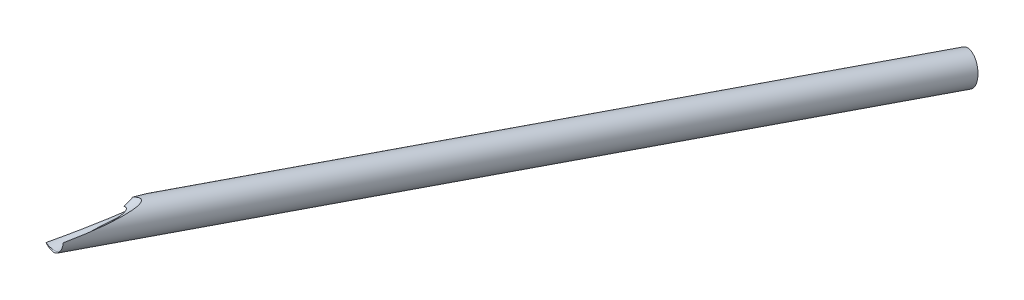
ISO-10303-21;
HEADER;
FILE_DESCRIPTION(('STEP AP214'),'2;1');
FILE_NAME('part.step','',(''),(''),'','','');
FILE_SCHEMA(('AUTOMOTIVE_DESIGN { 1 0 10303 214 1 1 1 1 }'));
ENDSEC;
DATA;
#1=APPLICATION_CONTEXT('core data for automotive mechanical design processes');
#2=APPLICATION_PROTOCOL_DEFINITION('international standard','automotive_design',2000,#1);
#3=PRODUCT_CONTEXT('',#1,'mechanical');
#4=PRODUCT('Part','Part','',(#3));
#5=PRODUCT_RELATED_PRODUCT_CATEGORY('part','',(#4));
#6=PRODUCT_DEFINITION_FORMATION('','',#4);
#7=PRODUCT_DEFINITION_CONTEXT('part definition',#1,'design');
#8=PRODUCT_DEFINITION('design','',#6,#7);
#9=PRODUCT_DEFINITION_SHAPE('','',#8);
#10=(LENGTH_UNIT() NAMED_UNIT(*) SI_UNIT(.MILLI.,.METRE.));
#11=(NAMED_UNIT(*) PLANE_ANGLE_UNIT() SI_UNIT($,.RADIAN.));
#12=(NAMED_UNIT(*) SI_UNIT($,.STERADIAN.) SOLID_ANGLE_UNIT());
#13=UNCERTAINTY_MEASURE_WITH_UNIT(LENGTH_MEASURE(1.E-05),#10,'distance_accuracy_value','');
#14=(GEOMETRIC_REPRESENTATION_CONTEXT(3) GLOBAL_UNCERTAINTY_ASSIGNED_CONTEXT((#13)) GLOBAL_UNIT_ASSIGNED_CONTEXT((#10,
#11,#12)) REPRESENTATION_CONTEXT('',''));
#15=CARTESIAN_POINT('',(0.,0.,0.));
#16=DIRECTION('',(0.,0.,1.));
#17=DIRECTION('',(1.,0.,0.));
#18=AXIS2_PLACEMENT_3D('',#15,#16,#17);
#19=CARTESIAN_POINT('',(204.165057136812,-72.1759348192313,0.));
#20=DIRECTION('',(-0.270716912176289,0.150111302046005,0.950883247543982));
#21=DIRECTION('',(0.961781089140047,0.,0.273819532854372));
#22=AXIS2_PLACEMENT_3D('',#19,#20,#21);
#23=CYLINDRICAL_SURFACE('',#22,6.35);
#24=CARTESIAN_POINT('',(201.504236252595,-70.7005216866344,9.34603598710279));
#25=DIRECTION('',(-0.270716912176287,0.150111302046004,0.950883247543982));
#26=DIRECTION('',(0.961781089140047,0.,0.27381953285437));
#27=AXIS2_PLACEMENT_3D('',#24,#25,#26);
#28=CIRCLE('',#27,6.35000000000003);
#29=CARTESIAN_POINT('',(207.611546168634,-70.7005216866344,11.084790020728));
#30=VERTEX_POINT('',#29);
#31=EDGE_CURVE('E125',#30,#30,#28,.F.);
#32=ORIENTED_EDGE('',*,*,#31,.T.);
#33=EDGE_LOOP('',(#32));
#34=FACE_BOUND('',#33,.T.);
#35=CARTESIAN_POINT('',(84.937381278847,-2.67825270101344,441.973305120907));
#36=CARTESIAN_POINT('',(85.0080305028037,-2.60997270455133,441.725150176863));
#37=CARTESIAN_POINT('',(85.0762820556866,-2.54390585253032,441.475710105905));
#38=CARTESIAN_POINT('',(85.2084455153859,-2.41572293297347,440.974669906557));
#39=CARTESIAN_POINT('',(85.2723572400839,-2.35360703124393,440.723069688015));
#40=CARTESIAN_POINT('',(85.4581669148907,-2.17251381806515,439.965441096851));
#41=CARTESIAN_POINT('',(85.5741123914815,-2.05881702012615,439.45668087914));
#42=CARTESIAN_POINT('',(85.7921748613013,-1.84258626363771,438.43321969733));
#43=CARTESIAN_POINT('',(85.8942744101389,-1.74006641814517,437.918512109638));
#44=CARTESIAN_POINT('',(86.0854160366441,-1.54421687573714,436.885011683273));
#45=CARTESIAN_POINT('',(86.1744595146209,-1.45088619360505,436.366219289008));
#46=CARTESIAN_POINT('',(86.3403085994945,-1.27113849599306,435.321802423362));
#47=CARTESIAN_POINT('',(86.4170274747312,-1.18477244209822,434.796155473834));
#48=CARTESIAN_POINT('',(86.5571213590262,-1.01834012400586,433.742059304372));
#49=CARTESIAN_POINT('',(86.6204955882662,-0.938274228140541,433.213609922522));
#50=CARTESIAN_POINT('',(86.7327971425554,-0.783512472736237,432.155040909262));
#51=CARTESIAN_POINT('',(86.7817415804266,-0.708810332340615,431.624924015988));
#52=CARTESIAN_POINT('',(86.8634963358982,-0.563873540305286,430.562860293761));
#53=CARTESIAN_POINT('',(86.8963084324885,-0.493638396812659,430.030913673098));
#54=CARTESIAN_POINT('',(86.9311870622714,-0.391271713272148,429.232777193159));
#55=CARTESIAN_POINT('',(86.9404203338568,-0.357693202982884,428.967076965773));
#56=CARTESIAN_POINT('',(86.9536145966935,-0.291433602136236,428.435437017015));
#57=CARTESIAN_POINT('',(86.9575757696242,-0.258752480692328,428.169497304211));
#58=CARTESIAN_POINT('',(86.9595786905414,-0.194196844193968,427.637167422242));
#59=CARTESIAN_POINT('',(86.9576132901291,-0.162323350008558,427.370777096741));
#60=CARTESIAN_POINT('',(86.9468967037916,-0.0993865110143857,426.838040676359));
#61=CARTESIAN_POINT('',(86.9381458239965,-0.0683231297223403,426.571694580025));
#62=CARTESIAN_POINT('',(86.9128516456834,-0.00726253004656791,426.041719337295));
#63=CARTESIAN_POINT('',(86.8963805439386,0.0227418532427247,425.778087674429));
#64=CARTESIAN_POINT('',(86.8541972764246,0.0819807579840199,425.251483336073));
#65=CARTESIAN_POINT('',(86.8284861279979,0.111215363809479,424.988510591244));
#66=CARTESIAN_POINT('',(86.765809295732,0.168837256545276,424.464279310444));
#67=CARTESIAN_POINT('',(86.7288639471016,0.197225973500198,424.203018541354));
#68=CARTESIAN_POINT('',(86.6407580401431,0.253121430519648,423.682851559662));
#69=CARTESIAN_POINT('',(86.589605877514,0.280628680822347,423.423944049411));
#70=CARTESIAN_POINT('',(86.5050383776016,0.318288515722412,423.065479579886));
#71=CARTESIAN_POINT('',(86.4795589911837,0.328892604863753,422.964086242846));
#72=CARTESIAN_POINT('',(86.4252180040416,0.349913503712436,422.762172795875));
#73=CARTESIAN_POINT('',(86.3963561052068,0.360330296819389,422.661652763752));
#74=CARTESIAN_POINT('',(86.3346729303103,0.380981677523946,422.461437716549));
#75=CARTESIAN_POINT('',(86.3018387726687,0.391215541737523,422.36174657014));
#76=CARTESIAN_POINT('',(86.2316877571649,0.411424487988732,422.163922572223));
#77=CARTESIAN_POINT('',(86.1943712002352,0.421399587344311,422.065789616604));
#78=CARTESIAN_POINT('',(86.1140277736969,0.441153673810756,421.87044442783));
#79=CARTESIAN_POINT('',(86.0709371698854,0.450928818134733,421.773257773685));
#80=CARTESIAN_POINT('',(85.9784678958168,0.470066893514413,421.581890195826));
#81=CARTESIAN_POINT('',(85.929091464149,0.47942996973132,421.487708216908));
#82=CARTESIAN_POINT('',(85.8230916780827,0.497585133611797,421.303892855089));
#83=CARTESIAN_POINT('',(85.7664972274021,0.506379298519382,421.214243220314));
#84=CARTESIAN_POINT('',(85.6446723250197,0.523238938799074,421.041016468724));
#85=CARTESIAN_POINT('',(85.5794533247249,0.53130535696603,420.957431523433));
#86=CARTESIAN_POINT('',(85.4422447535325,0.546101044379248,420.802523569224));
#87=CARTESIAN_POINT('',(85.370704180195,0.552874732856325,420.730813538967));
#88=CARTESIAN_POINT('',(85.2178512457452,0.565193904253794,420.598497876144));
#89=CARTESIAN_POINT('',(85.1365483192316,0.570740558506676,420.537881663));
#90=CARTESIAN_POINT('',(84.9635701217338,0.580291282418555,420.430887774213));
#91=CARTESIAN_POINT('',(84.8717912986951,0.58427784928626,420.384672777513));
#92=CARTESIAN_POINT('',(84.6809993124724,0.590302139186548,420.310773795971));
#93=CARTESIAN_POINT('',(84.5819918995642,0.592341393491483,420.283075255833));
#94=CARTESIAN_POINT('',(84.391790460157,0.594293202286596,420.24912129198));
#95=CARTESIAN_POINT('',(84.3009500404547,0.594416815540983,420.240825853012));
#96=CARTESIAN_POINT('',(84.1191098765807,0.593210537783619,420.238411669216));
#97=CARTESIAN_POINT('',(84.0281100626371,0.591879417186736,420.24430492217));
#98=CARTESIAN_POINT('',(83.8018970882141,0.586990199082746,420.27428059754));
#99=CARTESIAN_POINT('',(83.6677539154204,0.582643469747773,420.306094038862));
#100=CARTESIAN_POINT('',(83.4059478295686,0.571908664774682,420.389695701431));
#101=CARTESIAN_POINT('',(83.2783050249338,0.565514653726928,420.441542093027));
#102=CARTESIAN_POINT('',(83.0361375056442,0.551620586412859,420.556423684508));
#103=CARTESIAN_POINT('',(82.9212761128283,0.544191287522855,420.61877479968));
#104=CARTESIAN_POINT('',(82.6972043661229,0.528334923406585,420.752901613333));
#105=CARTESIAN_POINT('',(82.5879996881568,0.519906882888208,420.824686531699));
#106=CARTESIAN_POINT('',(82.3744300056348,0.502259257619862,420.975487783273));
#107=CARTESIAN_POINT('',(82.2700771776226,0.493037831191698,421.054520971449));
#108=CARTESIAN_POINT('',(82.0659020135235,0.4739750345233,421.218032114588));
#109=CARTESIAN_POINT('',(81.9660776811062,0.464133942115208,421.302507629827));
#110=CARTESIAN_POINT('',(81.7034806047597,0.437034530732887,421.534959757649));
#111=CARTESIAN_POINT('',(81.5442749814777,0.419300509371443,421.686905009782));
#112=CARTESIAN_POINT('',(81.2347506686814,0.382674971993209,421.999515586183));
#113=CARTESIAN_POINT('',(81.0844372752419,0.363782779557875,422.16018599992));
#114=CARTESIAN_POINT('',(80.790950483209,0.324990241715394,422.488337595234));
#115=CARTESIAN_POINT('',(80.6477914766495,0.305088014654001,422.65583136475));
#116=CARTESIAN_POINT('',(80.3677546897321,0.264418570248619,422.995894124924));
#117=CARTESIAN_POINT('',(80.2308776419599,0.243651252556,423.168463703679));
#118=CARTESIAN_POINT('',(79.9618227975446,0.201207081952711,423.518592001252));
#119=CARTESIAN_POINT('',(79.829674112556,0.179525951545262,423.696172499548));
#120=CARTESIAN_POINT('',(79.5701575345822,0.135397650615016,424.054701799508));
#121=CARTESIAN_POINT('',(79.4427898462329,0.112950447381178,424.235650744851));
#122=CARTESIAN_POINT('',(79.1924597557527,0.0673401097320157,424.600128534713));
#123=CARTESIAN_POINT('',(79.0694918764802,0.0441779374135338,424.783653745354));
#124=CARTESIAN_POINT('',(78.8273591346854,-0.00288434674947769,425.153096959294));
#125=CARTESIAN_POINT('',(78.7081942658161,-0.0267844573623242,425.3390149586));
#126=CARTESIAN_POINT('',(78.4353356190129,-0.0831769566518823,425.773376912111));
#127=CARTESIAN_POINT('',(78.2829372039621,-0.115948619516546,426.02259861156));
#128=CARTESIAN_POINT('',(77.983542898063,-0.18283101050999,426.524093647536));
#129=CARTESIAN_POINT('',(77.8365472699814,-0.216941803601533,426.776367131697));
#130=CARTESIAN_POINT('',(77.4028516191936,-0.32137736197956,427.537171086765));
#131=CARTESIAN_POINT('',(77.1234892968256,-0.393795666244797,428.049610280842));
#132=CARTESIAN_POINT('',(76.5811992874905,-0.545038971152154,429.083245630083));
#133=CARTESIAN_POINT('',(76.3183000388004,-0.62387454470454,429.604455066672));
#134=CARTESIAN_POINT('',(75.8079799528955,-0.788890385381323,430.653177884956));
#135=CARTESIAN_POINT('',(75.560557446469,-0.875069858068196,431.180690579491));
#136=CARTESIAN_POINT('',(75.0810957682887,-1.05602012673942,432.239801627647));
#137=CARTESIAN_POINT('',(74.8490246526294,-1.15077204459829,432.771388752706));
#138=CARTESIAN_POINT('',(74.3999239431565,-1.35095248158604,433.839011045153));
#139=CARTESIAN_POINT('',(74.1828962488181,-1.45638234485686,434.375046764714));
#140=CARTESIAN_POINT('',(73.8698439506913,-1.62438777131352,435.181386495062));
#141=CARTESIAN_POINT('',(73.7676470087654,-1.68198593462578,435.450343998386));
#142=CARTESIAN_POINT('',(73.5676532351348,-1.80090142366228,435.989068090836));
#143=CARTESIAN_POINT('',(73.4698562600505,-1.86221862804273,436.258834653292));
#144=CARTESIAN_POINT('',(73.2790734167838,-1.9890232100932,436.799021203405));
#145=CARTESIAN_POINT('',(73.1860864902179,-2.05450966324351,437.069441033495));
#146=CARTESIAN_POINT('',(73.0054352846793,-2.19020288824133,437.610864239436));
#147=CARTESIAN_POINT('',(72.917770675641,-2.2604093668043,437.881867578019));
#148=CARTESIAN_POINT('',(72.7689556405145,-2.3885318109825,438.35867844874));
#149=CARTESIAN_POINT('',(72.7065229667818,-2.44531024351264,438.564391520469));
#150=CARTESIAN_POINT('',(72.5855146931034,-2.56224792208473,438.975993636138));
#151=CARTESIAN_POINT('',(72.5269390466316,-2.62240712732921,439.181882677925));
#152=CARTESIAN_POINT('',(72.4140978332125,-2.74647495446592,439.593839973209));
#153=CARTESIAN_POINT('',(72.359834476084,-2.81038546991103,439.799908264578));
#154=CARTESIAN_POINT('',(72.2562474290405,-2.9422943245189,440.211984107201));
#155=CARTESIAN_POINT('',(72.206923701155,-3.01029263225277,440.417991658912));
#156=CARTESIAN_POINT('',(72.1141523271225,-3.15046061323131,440.828871411753));
#157=CARTESIAN_POINT('',(72.0706799696315,-3.22261078110797,441.033744643334));
#158=CARTESIAN_POINT('',(71.9902517273661,-3.37174077158584,441.443008303168));
#159=CARTESIAN_POINT('',(71.9532953672739,-3.44872024135157,441.647398765562));
#160=CARTESIAN_POINT('',(71.8870098015101,-3.60783514526978,442.055234654354));
#161=CARTESIAN_POINT('',(71.8576745639459,-3.68996643759248,442.258680702191));
#162=CARTESIAN_POINT('',(71.8079152681296,-3.85975855297408,442.664324617791));
#163=CARTESIAN_POINT('',(71.7874892257645,-3.94741813987747,442.866522753569));
#164=CARTESIAN_POINT('',(71.758065738038,-4.12285156734792,443.256565611251));
#165=CARTESIAN_POINT('',(71.7484341663121,-4.21027631031011,443.444518042067));
#166=CARTESIAN_POINT('',(71.7398984719202,-4.3902255851701,443.81823487519));
#167=CARTESIAN_POINT('',(71.7409938195902,-4.48274986504329,444.003999385077));
#168=CARTESIAN_POINT('',(71.7556167011107,-4.67272806631408,444.372625468295));
#169=CARTESIAN_POINT('',(71.7691489861283,-4.77018385820561,444.55548590505));
#170=CARTESIAN_POINT('',(71.810484711159,-4.9694305158372,444.917241056647));
#171=CARTESIAN_POINT('',(71.8382883318456,-5.07122143644454,445.096135721252));
#172=CARTESIAN_POINT('',(71.9105337813084,-5.27963704526854,445.451376739519));
#173=CARTESIAN_POINT('',(71.9552153181171,-5.38631092538263,445.627646414797));
#174=CARTESIAN_POINT('',(72.062890301996,-5.60139546802985,445.973468954403));
#175=CARTESIAN_POINT('',(72.1258835835338,-5.7098061148548,446.143021879431));
#176=CARTESIAN_POINT('',(72.2713489922908,-5.92592627956276,446.473689151645));
#177=CARTESIAN_POINT('',(72.3537928248498,-6.03363658453237,446.634815345093));
#178=CARTESIAN_POINT('',(72.5387877865923,-6.24571408193102,446.947450180609));
#179=CARTESIAN_POINT('',(72.6413343783746,-6.3500820225935,447.098960982774));
#180=CARTESIAN_POINT('',(72.8501986799369,-6.53794869350886,447.370274096783));
#181=CARTESIAN_POINT('',(72.9538877849965,-6.62229956962278,447.491515155285));
#182=CARTESIAN_POINT('',(73.1752049428883,-6.78434534325492,447.725432774879));
#183=CARTESIAN_POINT('',(73.2928320571195,-6.86204068835754,447.838109911838));
#184=CARTESIAN_POINT('',(73.5410014755878,-7.00894647823443,448.05442485209));
#185=CARTESIAN_POINT('',(73.6715443938176,-7.07815651928294,448.158062225209));
#186=CARTESIAN_POINT('',(73.9442071798887,-7.20646710806667,448.355927442824));
#187=CARTESIAN_POINT('',(74.086325806003,-7.2655687380291,448.450156294165));
#188=CARTESIAN_POINT('',(74.3595752529345,-7.36470212571249,448.616143519903));
#189=CARTESIAN_POINT('',(74.4893792488811,-7.40625170874984,448.689189504957));
#190=CARTESIAN_POINT('',(74.7553229268036,-7.48027878644805,448.827981255226));
#191=CARTESIAN_POINT('',(74.8914623380085,-7.51275666841207,448.893727332029));
#192=CARTESIAN_POINT('',(75.1689509554542,-7.56812592530696,449.017706397506));
#193=CARTESIAN_POINT('',(75.3102984169131,-7.59102047960219,449.075941873453));
#194=CARTESIAN_POINT('',(75.5971592937335,-7.62690086678141,449.184705752949));
#195=CARTESIAN_POINT('',(75.7426727958768,-7.63988649309907,449.235233995813));
#196=CARTESIAN_POINT('',(76.0345600607863,-7.65565092898676,449.327616743037));
#197=CARTESIAN_POINT('',(76.1808881678637,-7.65857994015972,449.369590000017));
#198=CARTESIAN_POINT('',(76.4754806498972,-7.65463224977457,449.445498505026));
#199=CARTESIAN_POINT('',(76.6237449718563,-7.6477558160505,449.479433972576));
#200=CARTESIAN_POINT('',(76.9211833486527,-7.62432891479109,449.538923225669));
#201=CARTESIAN_POINT('',(77.0703573753773,-7.60777874472026,449.564477268901));
#202=CARTESIAN_POINT('',(77.3686120427505,-7.56528767645124,449.606825923068));
#203=CARTESIAN_POINT('',(77.5176926831674,-7.53934675505122,449.623620512361));
#204=CARTESIAN_POINT('',(77.8148416420737,-7.47849845469441,449.648057242005));
#205=CARTESIAN_POINT('',(77.9629094694012,-7.44358700376828,449.655695216973));
#206=CARTESIAN_POINT('',(78.257006000833,-7.36539965020769,449.661410937325));
#207=CARTESIAN_POINT('',(78.4030347173582,-7.3221237985474,449.659488740969));
#208=CARTESIAN_POINT('',(78.6921108463632,-7.22796839769557,449.645728837004));
#209=CARTESIAN_POINT('',(78.8351588430958,-7.17709035489747,449.633893091655));
#210=CARTESIAN_POINT('',(79.1174495662207,-7.06862180518408,449.600027378384));
#211=CARTESIAN_POINT('',(79.2566923034266,-7.01103131734645,449.577997439434));
#212=CARTESIAN_POINT('',(79.5308542990873,-6.89005028749281,449.523526462126));
#213=CARTESIAN_POINT('',(79.6657652130206,-6.82664936328899,449.491066517397));
#214=CARTESIAN_POINT('',(79.9303330969133,-6.69525979534862,449.415733904113));
#215=CARTESIAN_POINT('',(80.0599901085787,-6.62727118804106,449.372861318234));
#216=CARTESIAN_POINT('',(80.3135023884355,-6.48788725112001,449.276867770271));
#217=CARTESIAN_POINT('',(80.4373590890594,-6.41649277149935,449.223749355239));
#218=CARTESIAN_POINT('',(80.6789670034065,-6.27142349535699,449.107608978742));
#219=CARTESIAN_POINT('',(80.7967159411985,-6.19774786491169,449.044583360324));
#220=CARTESIAN_POINT('',(81.1522260179709,-5.96734075985082,448.834369982766));
#221=CARTESIAN_POINT('',(81.3792603825392,-5.8085454458084,448.670968393717));
#222=CARTESIAN_POINT('',(81.8055834536102,-5.49432257267273,448.309004381315));
#223=CARTESIAN_POINT('',(82.0048544656947,-5.33889721414525,448.110419716195));
#224=CARTESIAN_POINT('',(82.3553024437591,-5.05530700678332,447.711900530629));
#225=CARTESIAN_POINT('',(82.5093793849841,-4.92614899340811,447.515174777916));
#226=CARTESIAN_POINT('',(82.8009639643703,-4.67593848433797,447.104873264629));
#227=CARTESIAN_POINT('',(82.9384594195662,-4.55489197710021,446.891285303191));
#228=CARTESIAN_POINT('',(83.1996285411916,-4.32118539680963,446.45054776092));
#229=CARTESIAN_POINT('',(83.3232608553907,-4.20855073248634,446.223360552684));
#230=CARTESIAN_POINT('',(83.5584906434451,-3.99186952853782,445.759026058967));
#231=CARTESIAN_POINT('',(83.6700903761304,-3.88782137786299,445.521880654556));
#232=CARTESIAN_POINT('',(83.8927051259333,-3.67879026584235,445.018360803539));
#233=CARTESIAN_POINT('',(84.0027801468639,-3.5745516904171,444.751265930834));
#234=CARTESIAN_POINT('',(84.2129548195547,-3.37461453578506,444.210073222469));
#235=CARTESIAN_POINT('',(84.3130537052716,-3.27891661245321,443.935974851055));
#236=CARTESIAN_POINT('',(84.504653822589,-3.0952546817672,443.382833973835));
#237=CARTESIAN_POINT('',(84.5961692114923,-3.00727795533362,443.103800544782));
#238=CARTESIAN_POINT('',(84.7719703221072,-2.83797930107965,442.541511097695));
#239=CARTESIAN_POINT('',(84.8562565089202,-2.756656945156,442.258255352689));
#240=CARTESIAN_POINT('',(84.937381278847,-2.67825270101344,441.973305120907));
#241=B_SPLINE_CURVE_WITH_KNOTS('',3,(#35,#36,#37,#38,#39,#40,#41,#42,#43,#44,#45,#46,#47,#48,
#49,#50,#51,#52,#53,#54,#55,#56,#57,#58,#59,#60,#61,#62,#63,#64,#65,#66,#67,#68,#69,#70,#71,#72,
#73,#74,#75,#76,#77,#78,#79,#80,#81,#82,#83,#84,#85,#86,#87,#88,#89,#90,#91,#92,#93,#94,#95,#96,
#97,#98,#99,#100,#101,#102,#103,#104,#105,#106,#107,#108,#109,#110,#111,#112,#113,#114,#115,
#116,#117,#118,#119,#120,#121,#122,#123,#124,#125,#126,#127,#128,#129,#130,#131,#132,#133,#134,
#135,#136,#137,#138,#139,#140,#141,#142,#143,#144,#145,#146,#147,#148,#149,#150,#151,#152,#153,
#154,#155,#156,#157,#158,#159,#160,#161,#162,#163,#164,#165,#166,#167,#168,#169,#170,#171,#172,
#173,#174,#175,#176,#177,#178,#179,#180,#181,#182,#183,#184,#185,#186,#187,#188,#189,#190,#191,
#192,#193,#194,#195,#196,#197,#198,#199,#200,#201,#202,#203,#204,#205,#206,#207,#208,#209,#210,
#211,#212,#213,#214,#215,#216,#217,#218,#219,#220,#221,#222,#223,#224,#225,#226,#227,#228,#229,
#230,#231,#232,#233,#234,#235,#236,#237,#238,#239,#240),.UNSPECIFIED.,.T.,.F.,(4,2,2,2,2,2,2,2,
2,2,2,2,2,2,2,2,2,2,2,2,2,2,2,2,2,2,2,2,2,2,2,2,2,2,2,2,2,2,2,2,2,2,2,2,2,2,2,2,2,2,2,2,2,2,2,2,
2,2,2,2,2,2,2,2,2,2,2,2,2,2,2,2,2,2,2,2,2,2,2,2,2,2,2,2,2,2,2,2,2,2,2,2,2,2,2,2,2,2,2,2,2,2,4),
(0.,0.800664008036102,1.6013615947447,3.20306592381328,4.80676984455766,6.41030163644727,
8.02466549851994,9.63912367268732,11.2516594276171,12.8640173206698,13.6678928952498,
14.4717407670986,15.2765585961646,16.0813401176017,16.8787413430232,17.6760548002898,
18.4719335331353,19.2673429283523,19.5825441971701,19.8977732664928,20.2140534628591,
20.5303124371434,20.8504049181262,21.170383720937,21.4891192310908,21.8074357056014,
22.1111208929469,22.4145149179218,22.7212213398494,23.0276863836006,23.3001117016028,
23.5727674599504,23.9841951917913,24.3968266886771,24.78895202403,25.1814634833265,
25.5749120154006,25.9681853807785,26.6300319479534,27.2922688123868,27.955788248912,
28.6193848677494,29.2865374223445,29.9537184998511,30.6200378867813,31.2863561616268,
32.1681437427903,33.0499741534805,34.8139004813198,36.5807942276188,38.3474970795312,
40.110399861283,41.8735248340652,42.7537623595573,43.6339711803501,44.513985492482,
45.3939451742984,46.0609438619281,46.7279345022782,47.3952647649071,48.0625898974401,
48.727001907818,49.3913654317417,50.0552015185644,50.7188896908901,51.3411251465862,
51.9633298782614,52.585772403854,53.2082228096931,53.8398678760721,54.4715072327628,
55.1022333502414,55.732817269867,56.2733733521404,56.8138930534377,57.3544384623719,
57.894925963131,58.3582716091802,58.8215974703328,59.2847694964553,59.7479511778227,
60.2041841376287,60.660404635749,61.1166111059635,61.5728187033402,62.0292337528211,
62.4856460209134,62.9419679694002,63.3982886209917,63.8554411517582,64.3125900528816,
64.7696254556255,65.2268299574142,66.187826095438,67.1494319305389,67.9920279014435,
68.8352392316356,69.6809023748892,70.5264064876433,71.4473246436704,72.3683134603829,
73.2877554882303,74.2071383179739),.UNSPECIFIED.);
#242=CARTESIAN_POINT('',(81.7557581661002,-5.5293616511283,448.345431097148));
#243=VERTEX_POINT('',#242);
#244=CARTESIAN_POINT('',(83.5075646380051,0.576055252690798,420.357437865418));
#245=VERTEX_POINT('',#244);
#246=EDGE_CURVE('E83',#243,#245,#241,.T.);
#247=ORIENTED_EDGE('',*,*,#246,.T.);
#248=CARTESIAN_POINT('',(83.353387505267,-1.7999353255921,447.537025286754));
#249=CARTESIAN_POINT('',(83.3823814230357,-1.64927343215477,447.435186860288));
#250=CARTESIAN_POINT('',(83.4067968427441,-1.50276063254372,447.325941827016));
#251=CARTESIAN_POINT('',(83.4477095795637,-1.21938697281774,447.094213628783));
#252=CARTESIAN_POINT('',(83.4642024844579,-1.08253152719651,446.971723133553));
#253=CARTESIAN_POINT('',(83.5038685007189,-0.687383541524821,446.586283110346));
#254=CARTESIAN_POINT('',(83.5171433692531,-0.445004974749652,446.305705544547));
#255=CARTESIAN_POINT('',(83.5257791379124,-0.0795514277678792,445.812589873971));
#256=CARTESIAN_POINT('',(83.5256756543172,0.05617144596745,445.609071623016));
#257=CARTESIAN_POINT('',(83.5208179537714,0.309316221959045,445.190862935455));
#258=CARTESIAN_POINT('',(83.516061692065,0.426730051638988,444.976167626145));
#259=CARTESIAN_POINT('',(83.5037827424455,0.64472582911068,444.53830598675));
#260=CARTESIAN_POINT('',(83.4962572114839,0.745290323703751,444.315131163143));
#261=CARTESIAN_POINT('',(83.4798258985856,0.931244745517141,443.862680938822));
#262=CARTESIAN_POINT('',(83.4709202728248,1.01663638740198,443.63340623082));
#263=CARTESIAN_POINT('',(83.4509232916993,1.18939705352513,443.125215432928));
#264=CARTESIAN_POINT('',(83.439744327456,1.27390533208701,442.845336578489));
#265=CARTESIAN_POINT('',(83.4178639295378,1.42667068432569,442.281109148351));
#266=CARTESIAN_POINT('',(83.4071626897539,1.4949212074322,441.996758820032));
#267=CARTESIAN_POINT('',(83.3868328391803,1.6176712869945,441.424639936079));
#268=CARTESIAN_POINT('',(83.3772059243913,1.67214926805666,441.136866747659));
#269=CARTESIAN_POINT('',(83.3593653953816,1.76927415685004,440.559351839258));
#270=CARTESIAN_POINT('',(83.3511516064292,1.81192252770236,440.269610367266));
#271=CARTESIAN_POINT('',(83.3362166435034,1.88737036126713,439.686752588955));
#272=CARTESIAN_POINT('',(83.3295063831909,1.92009838328224,439.393626883223));
#273=CARTESIAN_POINT('',(83.3176710073849,1.97673050393363,438.806499776728));
#274=CARTESIAN_POINT('',(83.3125459255696,2.00063441509707,438.512498357493));
#275=CARTESIAN_POINT('',(83.3038323357292,2.04077133505583,437.924233254407));
#276=CARTESIAN_POINT('',(83.3002424037187,2.05701145414131,437.629970068426));
#277=CARTESIAN_POINT('',(83.294498617659,2.08280815205757,437.041146579289));
#278=CARTESIAN_POINT('',(83.2923447569886,2.09236476170306,436.746586277508));
#279=CARTESIAN_POINT('',(83.2886182898672,2.10886517890798,436.011389415227));
#280=CARTESIAN_POINT('',(83.2878620269991,2.11217015666518,435.570666586916));
#281=CARTESIAN_POINT('',(83.2888787190398,2.10768805032132,434.689264754102));
#282=CARTESIAN_POINT('',(83.2906518935043,2.09990000334318,434.248585756725));
#283=CARTESIAN_POINT('',(83.2962968261941,2.07476612584818,433.367386559139));
#284=CARTESIAN_POINT('',(83.3001692295527,2.05741735711029,432.926866449428));
#285=CARTESIAN_POINT('',(83.309597381157,2.01432510877903,432.046253109759));
#286=CARTESIAN_POINT('',(83.3151531649528,1.98858145189876,431.606159889014));
#287=CARTESIAN_POINT('',(83.3275661984169,1.92951945784772,430.725689531601));
#288=CARTESIAN_POINT('',(83.3344258290148,1.89618724098118,430.285313367772));
#289=CARTESIAN_POINT('',(83.3490672501312,1.82262794179264,429.405153016289));
#290=CARTESIAN_POINT('',(83.356849046428,1.78240081626589,428.965368832361));
#291=CARTESIAN_POINT('',(83.372979476779,1.69553298410875,428.086534539355));
#292=CARTESIAN_POINT('',(83.3813279985499,1.64889354606104,427.647484302421));
#293=CARTESIAN_POINT('',(83.3982530877571,1.54951765711557,426.770074672441));
#294=CARTESIAN_POINT('',(83.4068296579177,1.49678113335545,426.331715287714));
#295=CARTESIAN_POINT('',(83.4238414643716,1.38563541038208,425.457549351463));
#296=CARTESIAN_POINT('',(83.432277137281,1.32725046936038,425.021739721697));
#297=CARTESIAN_POINT('',(83.4487108354839,1.20470394854027,424.150925148875));
#298=CARTESIAN_POINT('',(83.4567088608733,1.14054237000726,423.715920205642));
#299=CARTESIAN_POINT('',(83.4719240678928,1.00639858594808,422.846730009202));
#300=CARTESIAN_POINT('',(83.4791411365623,0.936415540965706,422.412544883477));
#301=CARTESIAN_POINT('',(83.4924244847144,0.790488590511556,421.545165851948));
#302=CARTESIAN_POINT('',(83.4984907833427,0.7145447842407,421.111971929771));
#303=CARTESIAN_POINT('',(83.5090560509939,0.556542682474829,420.247386117108));
#304=CARTESIAN_POINT('',(83.513557479388,0.474494229801299,419.81599246136));
#305=CARTESIAN_POINT('',(83.520539090256,0.303752378110859,418.954512092785));
#306=CARTESIAN_POINT('',(83.5230193196095,0.215059133264696,418.524425349875));
#307=CARTESIAN_POINT('',(83.525398935365,0.0304240282670437,417.665888905774));
#308=CARTESIAN_POINT('',(83.5252988360309,-0.0655163837116594,417.237438895404));
#309=CARTESIAN_POINT('',(83.521824485785,-0.265532228356564,416.382466072372));
#310=CARTESIAN_POINT('',(83.5184504207589,-0.369607198859494,415.955943151677));
#311=CARTESIAN_POINT('',(83.5102676431039,-0.532294941933906,415.31986898019));
#312=CARTESIAN_POINT('',(83.5070408922976,-0.587361413349793,415.109388415714));
#313=CARTESIAN_POINT('',(83.4994094788532,-0.700017433941955,414.689127748302));
#314=CARTESIAN_POINT('',(83.4950048181785,-0.757606978912143,414.4793476442));
#315=CARTESIAN_POINT('',(83.4797859562394,-0.934554199198527,413.851020555403));
#316=CARTESIAN_POINT('',(83.4669688358978,-1.05804684522663,413.433658913534));
#317=CARTESIAN_POINT('',(83.4423469530905,-1.25380047426869,412.810373968702));
#318=CARTESIAN_POINT('',(83.4332203730694,-1.32092592777498,412.602724996911));
#319=CARTESIAN_POINT('',(83.4128337666733,-1.45913582783625,412.188857942119));
#320=CARTESIAN_POINT('',(83.4015738454883,-1.53022007907047,411.982639789086));
#321=CARTESIAN_POINT('',(83.3765179574344,-1.67692323562069,411.57212887128));
#322=CARTESIAN_POINT('',(83.3627237238864,-1.75253901796153,411.367834890275));
#323=CARTESIAN_POINT('',(83.3320442199434,-1.90917527310296,410.961578274767));
#324=CARTESIAN_POINT('',(83.3151593044036,-1.99019512475973,410.759615375448));
#325=CARTESIAN_POINT('',(83.2773804336195,-2.15949966862574,410.357086157587));
#326=CARTESIAN_POINT('',(83.2564538624477,-2.24783987689084,410.156545990031));
#327=CARTESIAN_POINT('',(83.2095341680796,-2.43294916854688,409.759700458486));
#328=CARTESIAN_POINT('',(83.183535607158,-2.52972723609957,409.56339989294));
#329=CARTESIAN_POINT('',(83.1249618498547,-2.73348663145865,409.178605873685));
#330=CARTESIAN_POINT('',(83.0924291807945,-2.84039973397269,408.99007097797));
#331=CARTESIAN_POINT('',(83.0365739058962,-3.01156197750108,408.715648288545));
#332=CARTESIAN_POINT('',(83.0168002423378,-3.0703574917921,408.625647344777));
#333=CARTESIAN_POINT('',(82.9743640050283,-3.19227047376553,408.449351511121));
#334=CARTESIAN_POINT('',(82.9517026420426,-3.25538612498045,408.363055088147));
#335=CARTESIAN_POINT('',(82.8983134739763,-3.39890565998002,408.180072742009));
#336=CARTESIAN_POINT('',(82.8668686941376,-3.48035314143212,408.08439893716));
#337=CARTESIAN_POINT('',(82.7974590331424,-3.65224988853131,407.903960532922));
#338=CARTESIAN_POINT('',(82.7595029513521,-3.74268693720868,407.819181477363));
#339=CARTESIAN_POINT('',(82.6887932223328,-3.90326749982405,407.691835947897));
#340=CARTESIAN_POINT('',(82.6583079144511,-3.97055270911096,407.644472468974));
#341=CARTESIAN_POINT('',(82.5929882659275,-4.10999678951195,407.561221402486));
#342=CARTESIAN_POINT('',(82.5581615491961,-4.18214701767423,407.525314080925));
#343=CARTESIAN_POINT('',(82.4915073183792,-4.31559164464111,407.474451856419));
#344=CARTESIAN_POINT('',(82.4604494677272,-4.37620994180459,407.456757235509));
#345=CARTESIAN_POINT('',(82.3960616340001,-4.49850320954973,407.433049363752));
#346=CARTESIAN_POINT('',(82.3627341977678,-4.56017693939923,407.42702323548));
#347=CARTESIAN_POINT('',(82.2946736010635,-4.6828347686051,407.427351349435));
#348=CARTESIAN_POINT('',(82.2599383501695,-4.74381765652796,407.433724715936));
#349=CARTESIAN_POINT('',(82.1901915497482,-4.8632488218021,407.458122151179));
#350=CARTESIAN_POINT('',(82.1551797411139,-4.92169427446876,407.47615886583));
#351=CARTESIAN_POINT('',(82.0741227709005,-5.05391290403069,407.529808636236));
#352=CARTESIAN_POINT('',(82.0283201401493,-5.12624360399949,407.5692897772));
#353=CARTESIAN_POINT('',(81.9388531128302,-5.26374573848744,407.66102409377));
#354=CARTESIAN_POINT('',(81.895194172138,-5.32889938227129,407.713308016366));
#355=CARTESIAN_POINT('',(81.8147088563682,-5.4461416628826,407.82083956262));
#356=CARTESIAN_POINT('',(81.7776438370755,-5.49888441681377,407.875215138766));
#357=CARTESIAN_POINT('',(81.7053177399189,-5.59978220707919,407.989219551936));
#358=CARTESIAN_POINT('',(81.6700582803528,-5.64793316005405,408.048852975589));
#359=CARTESIAN_POINT('',(81.6011168908548,-5.7403814169143,408.172141786457));
#360=CARTESIAN_POINT('',(81.5674391370237,-5.78466875794195,408.235806881143));
#361=CARTESIAN_POINT('',(81.5015833186985,-5.86981802844634,408.366067680765));
#362=CARTESIAN_POINT('',(81.4694046846893,-5.91068126353011,408.432662253787));
#363=CARTESIAN_POINT('',(81.3869022934813,-6.01381571306749,408.609943262157));
#364=CARTESIAN_POINT('',(81.3376329347491,-6.07373961811773,408.722482753899));
#365=CARTESIAN_POINT('',(81.241895525676,-6.18757555822086,408.951746137133));
#366=CARTESIAN_POINT('',(81.195429123494,-6.24148407170946,409.068472427397));
#367=CARTESIAN_POINT('',(81.1047732040835,-6.34448881104472,409.305170873606));
#368=CARTESIAN_POINT('',(81.060588124316,-6.39357581421753,409.425148710846));
#369=CARTESIAN_POINT('',(80.9742294658003,-6.48766617626463,409.667416074564));
#370=CARTESIAN_POINT('',(80.9320562461974,-6.53266880730559,409.789706008382));
#371=CARTESIAN_POINT('',(80.8077235246895,-6.66296241824763,410.16044557976));
#372=CARTESIAN_POINT('',(80.7281840051161,-6.74305398990874,410.411608058108));
#373=CARTESIAN_POINT('',(80.6129858546347,-6.85542630359039,410.791606595862));
#374=CARTESIAN_POINT('',(80.5752934959987,-6.89156979633936,410.918736361785));
#375=CARTESIAN_POINT('',(80.5011244015413,-6.96158128872933,411.173973879532));
#376=CARTESIAN_POINT('',(80.4646476323342,-6.99544935089047,411.302081604376));
#377=CARTESIAN_POINT('',(80.3467097995167,-7.10332932464595,411.723906737632));
#378=CARTESIAN_POINT('',(80.2675421988666,-7.17313028607431,412.019344418077));
#379=CARTESIAN_POINT('',(80.1138488779023,-7.30456479954241,412.613247247499));
#380=CARTESIAN_POINT('',(80.0393239560811,-7.36619694867446,412.91171290705));
#381=CARTESIAN_POINT('',(79.8941934423747,-7.48283205993602,413.51105181198));
#382=CARTESIAN_POINT('',(79.8235899963783,-7.53783141141075,413.811926274446));
#383=CARTESIAN_POINT('',(79.6858454418163,-7.64226726769073,414.415436074172));
#384=CARTESIAN_POINT('',(79.6187045173173,-7.69170347692574,414.718071504094));
#385=CARTESIAN_POINT('',(79.4873603457433,-7.7859521367598,415.325514183008));
#386=CARTESIAN_POINT('',(79.4231649794056,-7.83075254507875,415.630324993199));
#387=CARTESIAN_POINT('',(79.2976267195093,-7.91621939719827,416.241114168295));
#388=CARTESIAN_POINT('',(79.2362838971076,-7.95688573790421,416.54709256212));
#389=CARTESIAN_POINT('',(79.0562637046697,-8.07343380537448,417.466280739955));
#390=CARTESIAN_POINT('',(78.9415484238554,-8.14389717125363,418.080958868765));
#391=CARTESIAN_POINT('',(78.7211850178799,-8.27359600558356,419.31600608086));
#392=CARTESIAN_POINT('',(78.615580581297,-8.33277886010162,419.936388333154));
#393=CARTESIAN_POINT('',(78.4135838445907,-8.44150770503112,421.179536267142));
#394=CARTESIAN_POINT('',(78.3171922633962,-8.49105294367902,421.802302130905));
#395=CARTESIAN_POINT('',(78.1337671627285,-8.58184326224916,423.048694934152));
#396=CARTESIAN_POINT('',(78.046717647835,-8.62310263825309,423.672318488459));
#397=CARTESIAN_POINT('',(77.882130037855,-8.6984410106737,424.921232597802));
#398=CARTESIAN_POINT('',(77.8045916583718,-8.73252022180956,425.546523102423));
#399=CARTESIAN_POINT('',(77.6598298174353,-8.79417119599335,426.797774411517));
#400=CARTESIAN_POINT('',(77.5925927629167,-8.82175156088968,427.423733215786));
#401=CARTESIAN_POINT('',(77.4694327149977,-8.87091065160229,428.677026114146));
#402=CARTESIAN_POINT('',(77.4135101052261,-8.89248917392875,429.304360254139));
#403=CARTESIAN_POINT('',(77.3145194395645,-8.92985967435212,430.561556858208));
#404=CARTESIAN_POINT('',(77.2714786475512,-8.94563939535482,431.191421865036));
#405=CARTESIAN_POINT('',(77.2007613970349,-8.97118534757571,432.452100340308));
#406=CARTESIAN_POINT('',(77.1730836725342,-8.98095207430354,433.082913726305));
#407=CARTESIAN_POINT('',(77.1365754638955,-8.9937718647888,434.338355120174));
#408=CARTESIAN_POINT('',(77.1275433799108,-8.99689675229106,434.96297582788));
#409=CARTESIAN_POINT('',(77.1311133247436,-8.99565073912116,435.899961822908));
#410=CARTESIAN_POINT('',(77.1351591738997,-8.99424552017202,436.21237038498));
#411=CARTESIAN_POINT('',(77.1497224099301,-8.98915692431986,436.837013074392));
#412=CARTESIAN_POINT('',(77.1602395056511,-8.98547364991068,437.149247208947));
#413=CARTESIAN_POINT('',(77.1885769706004,-8.97545698706272,437.772351564611));
#414=CARTESIAN_POINT('',(77.2063739551674,-8.96913208278502,438.083222960963));
#415=CARTESIAN_POINT('',(77.2503188883277,-8.95330127681425,438.704329313719));
#416=CARTESIAN_POINT('',(77.2764674076033,-8.94379515773828,439.014564225172));
#417=CARTESIAN_POINT('',(77.3383379500759,-8.92088648160012,439.633691555039));
#418=CARTESIAN_POINT('',(77.3740521743351,-8.90748709797267,439.942584859705));
#419=CARTESIAN_POINT('',(77.4565368000328,-8.87580714886858,440.558616045161));
#420=CARTESIAN_POINT('',(77.5033047541008,-8.85752766376352,440.865754299137));
#421=CARTESIAN_POINT('',(77.5764249909722,-8.82809494556677,441.286348305316));
#422=CARTESIAN_POINT('',(77.5972843595731,-8.8196216064633,441.400959852216));
#423=CARTESIAN_POINT('',(77.6409101575592,-8.80170184372137,441.62974353951));
#424=CARTESIAN_POINT('',(77.663676594095,-8.79225541643427,441.743915678255));
#425=CARTESIAN_POINT('',(77.735000673744,-8.76230969710944,442.0857015452));
#426=CARTESIAN_POINT('',(77.78657872786,-8.740205698729,442.312559354031));
#427=CARTESIAN_POINT('',(77.8987707038199,-8.69074103785482,442.763873137657));
#428=CARTESIAN_POINT('',(77.959399508847,-8.66337169513953,442.988324491103));
#429=CARTESIAN_POINT('',(78.0905657281177,-8.60221719564256,443.433454068282));
#430=CARTESIAN_POINT('',(78.1611029182547,-8.56843218396357,443.654132377226));
#431=CARTESIAN_POINT('',(78.313842427089,-8.49257020359186,444.092839548022));
#432=CARTESIAN_POINT('',(78.3961659616279,-8.45040504030565,444.31081149399));
#433=CARTESIAN_POINT('',(78.5726749055091,-8.35621251066231,444.739802425145));
#434=CARTESIAN_POINT('',(78.6668618674895,-8.30418385295932,444.950820495667));
#435=CARTESIAN_POINT('',(78.8673409225517,-8.18828343554005,445.36311964053));
#436=CARTESIAN_POINT('',(78.9736044817728,-8.12443937694304,445.564422129115));
#437=CARTESIAN_POINT('',(79.1981724243185,-7.98262288113739,445.954824718006));
#438=CARTESIAN_POINT('',(79.3164698352934,-7.90465860490075,446.143931781656));
#439=CARTESIAN_POINT('',(79.6038687863205,-7.70466513685666,446.564720025116));
#440=CARTESIAN_POINT('',(79.7771615520903,-7.57650776379713,446.790810851871));
#441=CARTESIAN_POINT('',(80.0476296499561,-7.35969657771748,447.103503892728));
#442=CARTESIAN_POINT('',(80.1395709424421,-7.28330255891886,447.20335482296));
#443=CARTESIAN_POINT('',(80.3259845206783,-7.12198907316976,447.393295015972));
#444=CARTESIAN_POINT('',(80.4204556151711,-7.03707356888695,447.483388775884));
#445=CARTESIAN_POINT('',(80.6115479559777,-6.8578673766003,447.653560236236));
#446=CARTESIAN_POINT('',(80.7081802830951,-6.76350803952247,447.733553351197));
#447=CARTESIAN_POINT('',(80.9015463077645,-6.56607717992349,447.881852064542));
#448=CARTESIAN_POINT('',(80.9982800075045,-6.46300546536642,447.950157405207));
#449=CARTESIAN_POINT('',(81.1904361606125,-6.24851818451934,448.074367294453));
#450=CARTESIAN_POINT('',(81.2858587634677,-6.13710357896089,448.130273267962));
#451=CARTESIAN_POINT('',(81.474003134897,-5.90652447673877,448.229144355622));
#452=CARTESIAN_POINT('',(81.5667252067602,-5.78736085524293,448.272110928063));
#453=CARTESIAN_POINT('',(81.7381963718908,-5.55557318217556,448.340731921115));
#454=CARTESIAN_POINT('',(81.8173628988868,-5.44366446071577,448.367767895971));
#455=CARTESIAN_POINT('',(81.9716668277809,-5.21508970152799,448.411090963853));
#456=CARTESIAN_POINT('',(82.0468044461049,-5.09842391993489,448.427378634791));
#457=CARTESIAN_POINT('',(82.1922939573572,-4.86120373591354,448.449094899999));
#458=CARTESIAN_POINT('',(82.262647005068,-4.74065028222557,448.454526123582));
#459=CARTESIAN_POINT('',(82.3979758387726,-4.49656501544084,448.454502470361));
#460=CARTESIAN_POINT('',(82.4629517869498,-4.37303329231954,448.449047922017));
#461=CARTESIAN_POINT('',(82.5837173829139,-4.13070856876496,448.427874974641));
#462=CARTESIAN_POINT('',(82.6398131257363,-4.01201795079117,448.412724267486));
#463=CARTESIAN_POINT('',(82.7464962425544,-3.77378621770313,448.372800241733));
#464=CARTESIAN_POINT('',(82.797083716408,-3.65424511804891,448.348027097614));
#465=CARTESIAN_POINT('',(82.8925694804927,-3.41531426103607,448.289026084545));
#466=CARTESIAN_POINT('',(82.9374712880023,-3.29592445579195,448.254804102945));
#467=CARTESIAN_POINT('',(83.0215869243996,-3.05818666379879,448.177135279167));
#468=CARTESIAN_POINT('',(83.0608014941086,-2.93983854324942,448.133689640286));
#469=CARTESIAN_POINT('',(83.1520268007907,-2.64578531680737,448.013646519647));
#470=CARTESIAN_POINT('',(83.2005134474194,-2.47126295013781,447.93138127095));
#471=CARTESIAN_POINT('',(83.2855671210451,-2.12953320252065,447.747951125124));
#472=CARTESIAN_POINT('',(83.3221368054048,-1.96232419797685,447.646790449411));
#473=CARTESIAN_POINT('',(83.353387505267,-1.7999353255921,447.537025286754));
#474=B_SPLINE_CURVE_WITH_KNOTS('',3,(#248,#249,#250,#251,#252,#253,#254,#255,#256,#257,#258,
#259,#260,#261,#262,#263,#264,#265,#266,#267,#268,#269,#270,#271,#272,#273,#274,#275,#276,#277,
#278,#279,#280,#281,#282,#283,#284,#285,#286,#287,#288,#289,#290,#291,#292,#293,#294,#295,#296,
#297,#298,#299,#300,#301,#302,#303,#304,#305,#306,#307,#308,#309,#310,#311,#312,#313,#314,#315,
#316,#317,#318,#319,#320,#321,#322,#323,#324,#325,#326,#327,#328,#329,#330,#331,#332,#333,#334,
#335,#336,#337,#338,#339,#340,#341,#342,#343,#344,#345,#346,#347,#348,#349,#350,#351,#352,#353,
#354,#355,#356,#357,#358,#359,#360,#361,#362,#363,#364,#365,#366,#367,#368,#369,#370,#371,#372,
#373,#374,#375,#376,#377,#378,#379,#380,#381,#382,#383,#384,#385,#386,#387,#388,#389,#390,#391,
#392,#393,#394,#395,#396,#397,#398,#399,#400,#401,#402,#403,#404,#405,#406,#407,#408,#409,#410,
#411,#412,#413,#414,#415,#416,#417,#418,#419,#420,#421,#422,#423,#424,#425,#426,#427,#428,#429,
#430,#431,#432,#433,#434,#435,#436,#437,#438,#439,#440,#441,#442,#443,#444,#445,#446,#447,#448,
#449,#450,#451,#452,#453,#454,#455,#456,#457,#458,#459,#460,#461,#462,#463,#464,#465,#466,#467,
#468,#469,#470,#471,#472,#473),.UNSPECIFIED.,.T.,.F.,(4,2,2,2,2,2,2,2,2,2,2,2,2,2,2,2,2,2,2,2,2,
2,2,2,2,2,2,2,2,2,2,2,2,2,2,2,2,2,2,2,2,2,2,2,2,2,2,2,2,2,2,2,2,2,2,2,2,2,2,2,2,2,2,2,2,2,2,2,2,
2,2,2,2,2,2,2,2,2,2,2,2,2,2,2,2,2,2,2,2,2,2,2,2,2,2,2,2,2,2,2,2,2,2,2,2,2,2,2,2,2,2,2,4),(0.,
0.552171893869692,1.104650948502,2.21140204175151,2.9444091930017,3.67773862358179,
4.41182303110682,5.14582442786492,6.0229401169667,6.90040861775229,7.77924331702918,
8.6579692709199,9.54288067030438,10.4278108690111,11.3119184277834,12.196021910302,
13.5180409848989,14.8401748180468,16.1627151989079,17.4852835115634,18.8102905557376,
20.1353059029513,21.4600594913566,22.784828912678,24.1041421065889,25.4234550114981,
26.7429584923885,28.0624400183285,29.3798383535527,30.6972061323025,32.0143113595063,
33.3313418099659,33.9840898371741,34.6368367762607,35.9428632102275,36.5980841961196,
37.2532728830439,37.9080151163285,38.5626822227812,39.2228716266974,39.8837727543061,
40.5405042092959,40.8682847790387,41.1959283651506,41.5838910899865,41.9713335941878,
42.2338569493522,42.495925617883,42.7061494211659,42.9161410875447,43.1264568898629,
43.3370011089087,43.6182383459538,43.9001577393386,44.152791762244,44.4056483904453,
44.6591388763936,44.9125322627143,45.3222680460541,45.7322424545043,46.1429863917287,
46.5538033802164,47.3794112191528,47.7917102398028,48.2039979274137,49.1449478270468,
50.0860591161262,51.0276804214817,51.9693517316616,52.913410828443,53.8574934622277,
55.7449910755907,57.6410876533209,59.5373320731302,61.4302761390625,63.3231635894318,
65.2135313681383,67.1039632311199,68.9983682786912,70.8926171941285,72.7662755555355,
73.7035292566883,74.6407407921674,75.5749651411626,76.5092533418244,77.4427821220375,
78.3761044059655,78.7264935586527,79.0768840251933,79.7777423061987,80.4797660495198,
81.1817739171147,81.8916035396532,82.6015261585802,83.3098049832419,84.0176757473373,
84.9507009644967,85.4175059569104,85.8840948724451,86.354363144728,86.8246417852442,
87.2948663535254,87.7650379069349,88.1836629460487,88.6022654747784,89.0207666102739,
89.439255118381,89.8352401740077,90.2312180497334,90.6269497554631,91.0226298666645,
91.6179136645408,92.2130646291432),.UNSPECIFIED.);
#475=EDGE_CURVE('E116',#245,#243,#474,.T.);
#476=ORIENTED_EDGE('',*,*,#475,.T.);
#477=EDGE_LOOP('',(#247,#476));
#478=FACE_BOUND('',#477,.T.);
#479=ADVANCED_FACE('F36',(#34,#478),#23,.F.);
#480=CARTESIAN_POINT('',(204.165057136812,-72.1759348192313,0.));
#481=DIRECTION('',(-0.270716912176289,0.150111302046005,0.950883247543982));
#482=DIRECTION('',(0.961781089140047,0.,0.273819532854372));
#483=AXIS2_PLACEMENT_3D('',#480,#481,#482);
#484=CYLINDRICAL_SURFACE('',#483,9.52499999999999);
#485=CARTESIAN_POINT('',(201.504236252595,-70.7005216866344,9.34603598710279));
#486=DIRECTION('',(-0.270716912176287,0.150111302046004,0.950883247543982));
#487=DIRECTION('',(0.961781089140047,0.,0.27381953285437));
#488=AXIS2_PLACEMENT_3D('',#485,#486,#487);
#489=CIRCLE('',#488,9.52499999999999);
#490=CARTESIAN_POINT('',(210.665201126654,-70.7005216866344,11.9541670375407));
#491=VERTEX_POINT('',#490);
#492=EDGE_CURVE('E135',#491,#491,#489,.F.);
#493=ORIENTED_EDGE('',*,*,#492,.F.);
#494=EDGE_LOOP('',(#493));
#495=FACE_BOUND('',#494,.T.);
#496=CARTESIAN_POINT('',(74.,0.,457.2));
#497=DIRECTION('',(-0.277508363855037,-0.0576045139736906,0.958994696523581));
#498=DIRECTION('',(0.00381544954876384,0.998126854994749,0.0610591818077588));
#499=AXIS2_PLACEMENT_3D('',#496,#497,#498);
#500=ELLIPSE('',#499,9.73556956140376,9.52499999999999);
#501=CARTESIAN_POINT('',(69.6290736332468,-8.46289712193301,455.426820537954));
#502=VERTEX_POINT('',#501);
#503=CARTESIAN_POINT('',(80.409682859104,-7.04567886336784,458.631580071816));
#504=VERTEX_POINT('',#503);
#505=EDGE_CURVE('E90',#502,#504,#500,.T.);
#506=ORIENTED_EDGE('',*,*,#505,.F.);
#507=CARTESIAN_POINT('',(74.,0.,457.2));
#508=DIRECTION('',(-0.863745042896468,0.478942715409442,-0.156711123498012));
#509=DIRECTION('',(-0.137051802029349,0.0759946036802452,0.987644482479395));
#510=AXIS2_PLACEMENT_3D('',#507,#508,#509);
#511=ELLIPSE('',#510,60.7806248043446,9.525);
#512=CARTESIAN_POINT('',(83.1702232239572,2.5753894895325,414.527401735599));
#513=VERTEX_POINT('',#512);
#514=EDGE_CURVE('E55',#513,#502,#511,.T.);
#515=ORIENTED_EDGE('',*,*,#514,.F.);
#516=CARTESIAN_POINT('',(74.,0.,457.2));
#517=DIRECTION('',(0.00381544954876384,0.998126854994749,0.0610591818077588));
#518=DIRECTION('',(-0.277508363855037,-0.0576045139736906,0.958994696523581));
#519=AXIS2_PLACEMENT_3D('',#516,#517,#518);
#520=ELLIPSE('',#519,46.0462205616307,9.52499999999999);
#521=CARTESIAN_POINT('',(83.524271376684,-0.117812322268034,458.530713307516));
#522=VERTEX_POINT('',#521);
#523=EDGE_CURVE('E92',#522,#513,#520,.T.);
#524=ORIENTED_EDGE('',*,*,#523,.F.);
#525=CARTESIAN_POINT('',(74.,0.,457.2));
#526=DIRECTION('',(-0.137051802029349,0.0759946036802452,0.987644482479395));
#527=DIRECTION('',(-0.863745042896468,0.478942715409442,-0.156711123498012));
#528=AXIS2_PLACEMENT_3D('',#525,#526,#527);
#529=ELLIPSE('',#528,9.64415857018543,9.525);
#530=EDGE_CURVE('E71',#504,#522,#529,.T.);
#531=ORIENTED_EDGE('',*,*,#530,.F.);
#532=EDGE_LOOP('',(#506,#515,#524,#531));
#533=FACE_BOUND('',#532,.T.);
#534=ADVANCED_FACE('F38',(#495,#533),#484,.T.);
#535=CARTESIAN_POINT('',(74.,0.,457.2));
#536=DIRECTION('',(0.,0.,-1.));
#537=DIRECTION('',(-1.,0.,0.));
#538=AXIS2_PLACEMENT_3D('',#535,#536,#537);
#539=CYLINDRICAL_SURFACE('',#538,9.52500000000001);
#540=ORIENTED_EDGE('',*,*,#530,.T.);
#541=CARTESIAN_POINT('',(74.,0.,457.2));
#542=DIRECTION('',(0.13875217529052,0.133928158846882,-0.981229372837989));
#543=DIRECTION('',(0.705998161317945,0.681452623691269,0.192844284022024));
#544=AXIS2_PLACEMENT_3D('',#541,#542,#543);
#545=ELLIPSE('',#544,9.70721042772196,9.525);
#546=CARTESIAN_POINT('',(80.6150040146943,-6.85327271349805,457.2));
#547=VERTEX_POINT('',#546);
#548=EDGE_CURVE('E79',#547,#522,#545,.F.);
#549=ORIENTED_EDGE('',*,*,#548,.F.);
#550=CARTESIAN_POINT('',(74.,0.,457.2));
#551=DIRECTION('',(0.705998161317945,0.681452623691269,0.192844284022024));
#552=DIRECTION('',(0.13875217529052,0.133928158846882,-0.981229372837989));
#553=AXIS2_PLACEMENT_3D('',#550,#551,#552);
#554=ELLIPSE('',#553,49.3921821344324,9.525);
#555=EDGE_CURVE('E46',#504,#547,#554,.T.);
#556=ORIENTED_EDGE('',*,*,#555,.F.);
#557=EDGE_LOOP('',(#540,#549,#556));
#558=FACE_BOUND('',#557,.T.);
#559=ADVANCED_FACE('F91',(#558),#539,.F.);
#560=CARTESIAN_POINT('',(73.9999999999999,0.,457.2));
#561=DIRECTION('',(0.272295419880448,0.262828486621345,-0.925622164240066));
#562=DIRECTION('',(-0.959350460020585,0.,-0.282217460229329));
#563=AXIS2_PLACEMENT_3D('',#560,#561,#562);
#564=CYLINDRICAL_SURFACE('',#563,9.52499999999999);
#565=CARTESIAN_POINT('',(74.,0.,457.2));
#566=DIRECTION('',(0.705998161317945,0.681452623691269,0.192844284022024));
#567=DIRECTION('',(0.13875217529052,0.133928158846882,-0.981229372837989));
#568=AXIS2_PLACEMENT_3D('',#565,#566,#567);
#569=ELLIPSE('',#568,49.3921821344324,9.525);
#570=EDGE_CURVE('E40',#243,#547,#569,.F.);
#571=ORIENTED_EDGE('',*,*,#570,.T.);
#572=ORIENTED_EDGE('',*,*,#548,.T.);
#573=ORIENTED_EDGE('',*,*,#523,.T.);
#574=EDGE_CURVE('E86',#513,#245,#569,.F.);
#575=ORIENTED_EDGE('',*,*,#574,.T.);
#576=ORIENTED_EDGE('',*,*,#246,.F.);
#577=EDGE_LOOP('',(#571,#572,#573,#575,#576));
#578=FACE_BOUND('',#577,.T.);
#579=ADVANCED_FACE('F78',(#578),#564,.F.);
#580=ORIENTED_EDGE('',*,*,#574,.F.);
#581=ORIENTED_EDGE('',*,*,#514,.T.);
#582=CARTESIAN_POINT('',(74.,0.,457.2));
#583=DIRECTION('',(0.13875217529052,0.133928158846882,-0.981229372837989));
#584=DIRECTION('',(0.705998161317945,0.681452623691269,0.192844284022024));
#585=AXIS2_PLACEMENT_3D('',#582,#583,#584);
#586=ELLIPSE('',#585,9.70721042772196,9.525);
#587=EDGE_CURVE('E11',#547,#502,#586,.T.);
#588=ORIENTED_EDGE('',*,*,#587,.F.);
#589=ORIENTED_EDGE('',*,*,#570,.F.);
#590=ORIENTED_EDGE('',*,*,#475,.F.);
#591=EDGE_LOOP('',(#580,#581,#588,#589,#590));
#592=FACE_BOUND('',#591,.T.);
#593=ADVANCED_FACE('F94',(#592),#539,.F.);
#594=ORIENTED_EDGE('',*,*,#505,.T.);
#595=ORIENTED_EDGE('',*,*,#555,.T.);
#596=ORIENTED_EDGE('',*,*,#587,.T.);
#597=EDGE_LOOP('',(#594,#595,#596));
#598=FACE_BOUND('',#597,.T.);
#599=ADVANCED_FACE('F88',(#598),#564,.F.);
#600=CARTESIAN_POINT('',(201.504236252595,-70.7005216866345,9.34603598710276));
#601=DIRECTION('',(-0.270716912176287,0.150111302046004,0.950883247543982));
#602=DIRECTION('',(-0.961781089140047,0.,-0.27381953285437));
#603=AXIS2_PLACEMENT_3D('',#600,#601,#602);
#604=PLANE('',#603);
#605=ORIENTED_EDGE('',*,*,#492,.T.);
#606=EDGE_LOOP('',(#605));
#607=FACE_BOUND('',#606,.T.);
#608=ORIENTED_EDGE('',*,*,#31,.F.);
#609=EDGE_LOOP('',(#608));
#610=FACE_BOUND('',#609,.T.);
#611=ADVANCED_FACE('F101',(#607,#610),#604,.F.);
#612=CLOSED_SHELL('',(#479,#534,#559,#579,#593,#599,#611));
#613=MANIFOLD_SOLID_BREP('B2',#612);
#614=ADVANCED_BREP_SHAPE_REPRESENTATION('',(#18,#613),#14);
#615=SHAPE_DEFINITION_REPRESENTATION(#9,#614);
ENDSEC;
END-ISO-10303-21;
